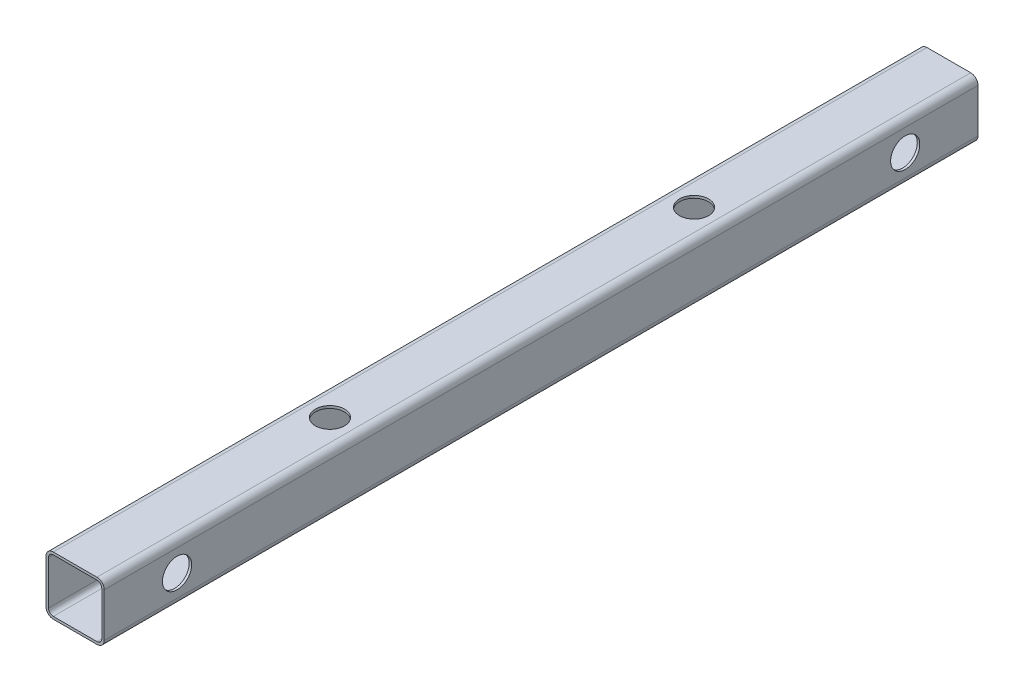
ISO-10303-21;
HEADER;
FILE_DESCRIPTION(('STEP AP214'),'2;1');
FILE_NAME('part.step','',(''),(''),'','','');
FILE_SCHEMA(('AUTOMOTIVE_DESIGN { 1 0 10303 214 1 1 1 1 }'));
ENDSEC;
DATA;
#1=APPLICATION_CONTEXT('core data for automotive mechanical design processes');
#2=APPLICATION_PROTOCOL_DEFINITION('international standard','automotive_design',2000,#1);
#3=PRODUCT_CONTEXT('',#1,'mechanical');
#4=PRODUCT('Part','Part','',(#3));
#5=PRODUCT_RELATED_PRODUCT_CATEGORY('part','',(#4));
#6=PRODUCT_DEFINITION_FORMATION('','',#4);
#7=PRODUCT_DEFINITION_CONTEXT('part definition',#1,'design');
#8=PRODUCT_DEFINITION('design','',#6,#7);
#9=PRODUCT_DEFINITION_SHAPE('','',#8);
#10=(LENGTH_UNIT() NAMED_UNIT(*) SI_UNIT(.MILLI.,.METRE.));
#11=(NAMED_UNIT(*) PLANE_ANGLE_UNIT() SI_UNIT($,.RADIAN.));
#12=(NAMED_UNIT(*) SI_UNIT($,.STERADIAN.) SOLID_ANGLE_UNIT());
#13=UNCERTAINTY_MEASURE_WITH_UNIT(LENGTH_MEASURE(1.E-05),#10,'distance_accuracy_value','');
#14=(GEOMETRIC_REPRESENTATION_CONTEXT(3) GLOBAL_UNCERTAINTY_ASSIGNED_CONTEXT((#13)) GLOBAL_UNIT_ASSIGNED_CONTEXT((#10,
#11,#12)) REPRESENTATION_CONTEXT('',''));
#15=CARTESIAN_POINT('',(0.,0.,0.));
#16=DIRECTION('',(0.,0.,1.));
#17=DIRECTION('',(1.,0.,0.));
#18=AXIS2_PLACEMENT_3D('',#15,#16,#17);
#19=CARTESIAN_POINT('',(-6.,-6.,-120.));
#20=DIRECTION('',(0.,0.,1.));
#21=DIRECTION('',(1.,0.,0.));
#22=AXIS2_PLACEMENT_3D('',#19,#20,#21);
#23=CYLINDRICAL_SURFACE('',#22,2.);
#24=DIRECTION('',(0.,0.,1.));
#25=VECTOR('',#24,1.);
#26=CARTESIAN_POINT('',(-5.99999999999999,-8.,-120.));
#27=LINE('',#26,#25);
#28=CARTESIAN_POINT('',(-5.99999999999999,-8.,-120.));
#29=VERTEX_POINT('',#28);
#30=CARTESIAN_POINT('',(-5.99999999999999,-8.,120.));
#31=VERTEX_POINT('',#30);
#32=EDGE_CURVE('E270',#29,#31,#27,.T.);
#33=ORIENTED_EDGE('',*,*,#32,.T.);
#34=CARTESIAN_POINT('',(-6.,-6.,120.));
#35=DIRECTION('',(0.,0.,1.));
#36=DIRECTION('',(-1.,0.,0.));
#37=AXIS2_PLACEMENT_3D('',#34,#35,#36);
#38=CIRCLE('',#37,2.);
#39=CARTESIAN_POINT('',(-8.,-5.99999999999999,120.));
#40=VERTEX_POINT('',#39);
#41=EDGE_CURVE('E194',#40,#31,#38,.T.);
#42=ORIENTED_EDGE('',*,*,#41,.F.);
#43=DIRECTION('',(0.,0.,1.));
#44=VECTOR('',#43,1.);
#45=CARTESIAN_POINT('',(-8.,-5.99999999999999,-120.));
#46=LINE('',#45,#44);
#47=CARTESIAN_POINT('',(-8.,-5.99999999999999,-120.));
#48=VERTEX_POINT('',#47);
#49=EDGE_CURVE('E11',#48,#40,#46,.T.);
#50=ORIENTED_EDGE('',*,*,#49,.F.);
#51=CARTESIAN_POINT('',(-6.,-6.,-120.));
#52=DIRECTION('',(0.,0.,1.));
#53=DIRECTION('',(-1.,0.,0.));
#54=AXIS2_PLACEMENT_3D('',#51,#52,#53);
#55=CIRCLE('',#54,2.);
#56=EDGE_CURVE('E237',#48,#29,#55,.T.);
#57=ORIENTED_EDGE('',*,*,#56,.T.);
#58=EDGE_LOOP('',(#33,#42,#50,#57));
#59=FACE_BOUND('',#58,.T.);
#60=ADVANCED_FACE('F36',(#59),#23,.T.);
#61=CARTESIAN_POINT('',(-8.,-5.99999999999999,-120.));
#62=DIRECTION('',(-1.,0.,0.));
#63=DIRECTION('',(0.,0.,1.));
#64=AXIS2_PLACEMENT_3D('',#61,#62,#63);
#65=PLANE('',#64);
#66=CARTESIAN_POINT('',(-8.,0.,100.));
#67=DIRECTION('',(1.,0.,0.));
#68=DIRECTION('',(0.,0.,-1.));
#69=AXIS2_PLACEMENT_3D('',#66,#67,#68);
#70=CIRCLE('',#69,3.99999999999999);
#71=CARTESIAN_POINT('',(-8.,0.,96.));
#72=VERTEX_POINT('',#71);
#73=EDGE_CURVE('E296',#72,#72,#70,.T.);
#74=ORIENTED_EDGE('',*,*,#73,.T.);
#75=EDGE_LOOP('',(#74));
#76=FACE_BOUND('',#75,.T.);
#77=CARTESIAN_POINT('',(-8.,0.,-100.));
#78=DIRECTION('',(1.,0.,0.));
#79=DIRECTION('',(0.,0.,1.));
#80=AXIS2_PLACEMENT_3D('',#77,#78,#79);
#81=CIRCLE('',#80,3.99999999999999);
#82=CARTESIAN_POINT('',(-8.,0.,-96.));
#83=VERTEX_POINT('',#82);
#84=EDGE_CURVE('E307',#83,#83,#81,.T.);
#85=ORIENTED_EDGE('',*,*,#84,.T.);
#86=EDGE_LOOP('',(#85));
#87=FACE_BOUND('',#86,.T.);
#88=ORIENTED_EDGE('',*,*,#49,.T.);
#89=DIRECTION('',(0.,-1.,0.));
#90=VECTOR('',#89,1.);
#91=CARTESIAN_POINT('',(-8.,-5.99999999999999,120.));
#92=LINE('',#91,#90);
#93=CARTESIAN_POINT('',(-8.,5.99999999999999,120.));
#94=VERTEX_POINT('',#93);
#95=EDGE_CURVE('E215',#94,#40,#92,.T.);
#96=ORIENTED_EDGE('',*,*,#95,.F.);
#97=DIRECTION('',(0.,0.,1.));
#98=VECTOR('',#97,1.);
#99=CARTESIAN_POINT('',(-8.,5.99999999999999,-120.));
#100=LINE('',#99,#98);
#101=CARTESIAN_POINT('',(-8.,5.99999999999999,-120.));
#102=VERTEX_POINT('',#101);
#103=EDGE_CURVE('E44',#102,#94,#100,.T.);
#104=ORIENTED_EDGE('',*,*,#103,.F.);
#105=DIRECTION('',(0.,-1.,0.));
#106=VECTOR('',#105,1.);
#107=CARTESIAN_POINT('',(-8.,-5.99999999999999,-120.));
#108=LINE('',#107,#106);
#109=EDGE_CURVE('E268',#102,#48,#108,.T.);
#110=ORIENTED_EDGE('',*,*,#109,.T.);
#111=EDGE_LOOP('',(#88,#96,#104,#110));
#112=FACE_BOUND('',#111,.T.);
#113=ADVANCED_FACE('F351',(#76,#87,#112),#65,.T.);
#114=CARTESIAN_POINT('',(-6.,6.,-120.));
#115=DIRECTION('',(0.,0.,1.));
#116=DIRECTION('',(1.,0.,0.));
#117=AXIS2_PLACEMENT_3D('',#114,#115,#116);
#118=CYLINDRICAL_SURFACE('',#117,2.);
#119=ORIENTED_EDGE('',*,*,#103,.T.);
#120=CARTESIAN_POINT('',(-6.,6.,120.));
#121=DIRECTION('',(0.,0.,1.));
#122=DIRECTION('',(-1.,0.,0.));
#123=AXIS2_PLACEMENT_3D('',#120,#121,#122);
#124=CIRCLE('',#123,2.);
#125=CARTESIAN_POINT('',(-5.99999999999999,8.,120.));
#126=VERTEX_POINT('',#125);
#127=EDGE_CURVE('E212',#126,#94,#124,.T.);
#128=ORIENTED_EDGE('',*,*,#127,.F.);
#129=DIRECTION('',(0.,0.,1.));
#130=VECTOR('',#129,1.);
#131=CARTESIAN_POINT('',(-5.99999999999999,8.,-120.));
#132=LINE('',#131,#130);
#133=CARTESIAN_POINT('',(-5.99999999999999,8.,-120.));
#134=VERTEX_POINT('',#133);
#135=EDGE_CURVE('E273',#134,#126,#132,.T.);
#136=ORIENTED_EDGE('',*,*,#135,.F.);
#137=CARTESIAN_POINT('',(-6.,6.,-120.));
#138=DIRECTION('',(0.,0.,1.));
#139=DIRECTION('',(-1.,0.,0.));
#140=AXIS2_PLACEMENT_3D('',#137,#138,#139);
#141=CIRCLE('',#140,2.);
#142=EDGE_CURVE('E265',#134,#102,#141,.T.);
#143=ORIENTED_EDGE('',*,*,#142,.T.);
#144=EDGE_LOOP('',(#119,#128,#136,#143));
#145=FACE_BOUND('',#144,.T.);
#146=ADVANCED_FACE('F338',(#145),#118,.T.);
#147=CARTESIAN_POINT('',(-5.99999999999999,8.,-120.));
#148=DIRECTION('',(0.,1.,0.));
#149=DIRECTION('',(0.,0.,1.));
#150=AXIS2_PLACEMENT_3D('',#147,#148,#149);
#151=PLANE('',#150);
#152=CARTESIAN_POINT('',(0.,8.,-50.));
#153=DIRECTION('',(0.,1.,0.));
#154=DIRECTION('',(0.,0.,1.));
#155=AXIS2_PLACEMENT_3D('',#152,#153,#154);
#156=CIRCLE('',#155,4.);
#157=CARTESIAN_POINT('',(0.,8.,-46.));
#158=VERTEX_POINT('',#157);
#159=EDGE_CURVE('E322',#158,#158,#156,.F.);
#160=ORIENTED_EDGE('',*,*,#159,.T.);
#161=EDGE_LOOP('',(#160));
#162=FACE_BOUND('',#161,.T.);
#163=CARTESIAN_POINT('',(0.,8.,50.));
#164=DIRECTION('',(0.,1.,0.));
#165=DIRECTION('',(0.,0.,1.));
#166=AXIS2_PLACEMENT_3D('',#163,#164,#165);
#167=CIRCLE('',#166,4.);
#168=CARTESIAN_POINT('',(0.,8.,54.));
#169=VERTEX_POINT('',#168);
#170=EDGE_CURVE('E170',#169,#169,#167,.T.);
#171=ORIENTED_EDGE('',*,*,#170,.F.);
#172=EDGE_LOOP('',(#171));
#173=FACE_BOUND('',#172,.T.);
#174=ORIENTED_EDGE('',*,*,#135,.T.);
#175=DIRECTION('',(-1.,0.,0.));
#176=VECTOR('',#175,1.);
#177=CARTESIAN_POINT('',(-5.99999999999999,8.,120.));
#178=LINE('',#177,#176);
#179=CARTESIAN_POINT('',(5.99999999999999,8.,120.));
#180=VERTEX_POINT('',#179);
#181=EDGE_CURVE('E209',#180,#126,#178,.T.);
#182=ORIENTED_EDGE('',*,*,#181,.F.);
#183=DIRECTION('',(0.,0.,1.));
#184=VECTOR('',#183,1.);
#185=CARTESIAN_POINT('',(5.99999999999999,8.,-120.));
#186=LINE('',#185,#184);
#187=CARTESIAN_POINT('',(5.99999999999999,8.,-120.));
#188=VERTEX_POINT('',#187);
#189=EDGE_CURVE('E275',#188,#180,#186,.T.);
#190=ORIENTED_EDGE('',*,*,#189,.F.);
#191=DIRECTION('',(-1.,0.,0.));
#192=VECTOR('',#191,1.);
#193=CARTESIAN_POINT('',(-5.99999999999999,8.,-120.));
#194=LINE('',#193,#192);
#195=EDGE_CURVE('E262',#188,#134,#194,.T.);
#196=ORIENTED_EDGE('',*,*,#195,.T.);
#197=EDGE_LOOP('',(#174,#182,#190,#196));
#198=FACE_BOUND('',#197,.T.);
#199=ADVANCED_FACE('F334',(#162,#173,#198),#151,.T.);
#200=CARTESIAN_POINT('',(6.,6.,-120.));
#201=DIRECTION('',(0.,0.,1.));
#202=DIRECTION('',(1.,0.,0.));
#203=AXIS2_PLACEMENT_3D('',#200,#201,#202);
#204=CYLINDRICAL_SURFACE('',#203,2.);
#205=ORIENTED_EDGE('',*,*,#189,.T.);
#206=CARTESIAN_POINT('',(6.,6.,120.));
#207=DIRECTION('',(0.,0.,1.));
#208=DIRECTION('',(-1.,0.,0.));
#209=AXIS2_PLACEMENT_3D('',#206,#207,#208);
#210=CIRCLE('',#209,2.);
#211=CARTESIAN_POINT('',(8.,5.99999999999999,120.));
#212=VERTEX_POINT('',#211);
#213=EDGE_CURVE('E206',#212,#180,#210,.T.);
#214=ORIENTED_EDGE('',*,*,#213,.F.);
#215=DIRECTION('',(0.,0.,1.));
#216=VECTOR('',#215,1.);
#217=CARTESIAN_POINT('',(8.,5.99999999999999,-120.));
#218=LINE('',#217,#216);
#219=CARTESIAN_POINT('',(8.,5.99999999999999,-120.));
#220=VERTEX_POINT('',#219);
#221=EDGE_CURVE('E277',#220,#212,#218,.T.);
#222=ORIENTED_EDGE('',*,*,#221,.F.);
#223=CARTESIAN_POINT('',(6.,6.,-120.));
#224=DIRECTION('',(0.,0.,1.));
#225=DIRECTION('',(-1.,0.,0.));
#226=AXIS2_PLACEMENT_3D('',#223,#224,#225);
#227=CIRCLE('',#226,2.);
#228=EDGE_CURVE('E259',#220,#188,#227,.T.);
#229=ORIENTED_EDGE('',*,*,#228,.T.);
#230=EDGE_LOOP('',(#205,#214,#222,#229));
#231=FACE_BOUND('',#230,.T.);
#232=ADVANCED_FACE('F337',(#231),#204,.T.);
#233=CARTESIAN_POINT('',(8.,-5.99999999999999,-120.));
#234=DIRECTION('',(1.,0.,0.));
#235=DIRECTION('',(0.,0.,-1.));
#236=AXIS2_PLACEMENT_3D('',#233,#234,#235);
#237=PLANE('',#236);
#238=CARTESIAN_POINT('',(8.,0.,100.));
#239=DIRECTION('',(1.,0.,0.));
#240=DIRECTION('',(0.,0.,-1.));
#241=AXIS2_PLACEMENT_3D('',#238,#239,#240);
#242=CIRCLE('',#241,3.99999999999999);
#243=CARTESIAN_POINT('',(8.,0.,96.));
#244=VERTEX_POINT('',#243);
#245=EDGE_CURVE('E302',#244,#244,#242,.T.);
#246=ORIENTED_EDGE('',*,*,#245,.F.);
#247=EDGE_LOOP('',(#246));
#248=FACE_BOUND('',#247,.T.);
#249=CARTESIAN_POINT('',(8.,0.,-100.));
#250=DIRECTION('',(1.,0.,0.));
#251=DIRECTION('',(0.,0.,1.));
#252=AXIS2_PLACEMENT_3D('',#249,#250,#251);
#253=CIRCLE('',#252,3.99999999999999);
#254=CARTESIAN_POINT('',(8.,0.,-96.));
#255=VERTEX_POINT('',#254);
#256=EDGE_CURVE('E312',#255,#255,#253,.T.);
#257=ORIENTED_EDGE('',*,*,#256,.F.);
#258=EDGE_LOOP('',(#257));
#259=FACE_BOUND('',#258,.T.);
#260=ORIENTED_EDGE('',*,*,#221,.T.);
#261=DIRECTION('',(0.,1.,0.));
#262=VECTOR('',#261,1.);
#263=CARTESIAN_POINT('',(8.,-5.99999999999999,120.));
#264=LINE('',#263,#262);
#265=CARTESIAN_POINT('',(8.,-6.,120.));
#266=VERTEX_POINT('',#265);
#267=EDGE_CURVE('E203',#266,#212,#264,.T.);
#268=ORIENTED_EDGE('',*,*,#267,.F.);
#269=DIRECTION('',(0.,0.,1.));
#270=VECTOR('',#269,1.);
#271=CARTESIAN_POINT('',(8.,-6.,-120.));
#272=LINE('',#271,#270);
#273=CARTESIAN_POINT('',(8.,-6.,-120.));
#274=VERTEX_POINT('',#273);
#275=EDGE_CURVE('E279',#274,#266,#272,.T.);
#276=ORIENTED_EDGE('',*,*,#275,.F.);
#277=DIRECTION('',(0.,1.,0.));
#278=VECTOR('',#277,1.);
#279=CARTESIAN_POINT('',(8.,-5.99999999999999,-120.));
#280=LINE('',#279,#278);
#281=EDGE_CURVE('E256',#274,#220,#280,.T.);
#282=ORIENTED_EDGE('',*,*,#281,.T.);
#283=EDGE_LOOP('',(#260,#268,#276,#282));
#284=FACE_BOUND('',#283,.T.);
#285=ADVANCED_FACE('F363',(#248,#259,#284),#237,.T.);
#286=CARTESIAN_POINT('',(6.,-6.,-120.));
#287=DIRECTION('',(0.,0.,1.));
#288=DIRECTION('',(1.,0.,0.));
#289=AXIS2_PLACEMENT_3D('',#286,#287,#288);
#290=CYLINDRICAL_SURFACE('',#289,2.);
#291=ORIENTED_EDGE('',*,*,#275,.T.);
#292=CARTESIAN_POINT('',(6.,-6.,120.));
#293=DIRECTION('',(0.,0.,1.));
#294=DIRECTION('',(1.,0.,0.));
#295=AXIS2_PLACEMENT_3D('',#292,#293,#294);
#296=CIRCLE('',#295,2.);
#297=CARTESIAN_POINT('',(5.99999999999999,-8.,120.));
#298=VERTEX_POINT('',#297);
#299=EDGE_CURVE('E200',#298,#266,#296,.T.);
#300=ORIENTED_EDGE('',*,*,#299,.F.);
#301=DIRECTION('',(0.,0.,1.));
#302=VECTOR('',#301,1.);
#303=CARTESIAN_POINT('',(5.99999999999999,-8.,-120.));
#304=LINE('',#303,#302);
#305=CARTESIAN_POINT('',(5.99999999999999,-8.,-120.));
#306=VERTEX_POINT('',#305);
#307=EDGE_CURVE('E281',#306,#298,#304,.T.);
#308=ORIENTED_EDGE('',*,*,#307,.F.);
#309=CARTESIAN_POINT('',(6.,-6.,-120.));
#310=DIRECTION('',(0.,0.,1.));
#311=DIRECTION('',(1.,0.,0.));
#312=AXIS2_PLACEMENT_3D('',#309,#310,#311);
#313=CIRCLE('',#312,2.);
#314=EDGE_CURVE('E253',#306,#274,#313,.T.);
#315=ORIENTED_EDGE('',*,*,#314,.T.);
#316=EDGE_LOOP('',(#291,#300,#308,#315));
#317=FACE_BOUND('',#316,.T.);
#318=ADVANCED_FACE('F359',(#317),#290,.T.);
#319=CARTESIAN_POINT('',(-5.99999999999999,-8.,-120.));
#320=DIRECTION('',(0.,-1.,0.));
#321=DIRECTION('',(0.,0.,-1.));
#322=AXIS2_PLACEMENT_3D('',#319,#320,#321);
#323=PLANE('',#322);
#324=CARTESIAN_POINT('',(0.,-8.,-50.));
#325=DIRECTION('',(0.,-1.,0.));
#326=DIRECTION('',(0.,0.,-1.));
#327=AXIS2_PLACEMENT_3D('',#324,#325,#326);
#328=CIRCLE('',#327,4.);
#329=CARTESIAN_POINT('',(0.,-8.,-54.));
#330=VERTEX_POINT('',#329);
#331=EDGE_CURVE('E292',#330,#330,#328,.T.);
#332=ORIENTED_EDGE('',*,*,#331,.F.);
#333=EDGE_LOOP('',(#332));
#334=FACE_BOUND('',#333,.T.);
#335=CARTESIAN_POINT('',(0.,-8.,50.));
#336=DIRECTION('',(0.,1.,0.));
#337=DIRECTION('',(0.,0.,1.));
#338=AXIS2_PLACEMENT_3D('',#335,#336,#337);
#339=CIRCLE('',#338,4.);
#340=CARTESIAN_POINT('',(0.,-8.,54.));
#341=VERTEX_POINT('',#340);
#342=EDGE_CURVE('E288',#341,#341,#339,.T.);
#343=ORIENTED_EDGE('',*,*,#342,.T.);
#344=EDGE_LOOP('',(#343));
#345=FACE_BOUND('',#344,.T.);
#346=ORIENTED_EDGE('',*,*,#307,.T.);
#347=DIRECTION('',(1.,0.,0.));
#348=VECTOR('',#347,1.);
#349=CARTESIAN_POINT('',(-5.99999999999999,-8.,120.));
#350=LINE('',#349,#348);
#351=EDGE_CURVE('E197',#31,#298,#350,.T.);
#352=ORIENTED_EDGE('',*,*,#351,.F.);
#353=ORIENTED_EDGE('',*,*,#32,.F.);
#354=DIRECTION('',(1.,0.,0.));
#355=VECTOR('',#354,1.);
#356=CARTESIAN_POINT('',(-5.99999999999999,-8.,-120.));
#357=LINE('',#356,#355);
#358=EDGE_CURVE('E250',#29,#306,#357,.T.);
#359=ORIENTED_EDGE('',*,*,#358,.T.);
#360=EDGE_LOOP('',(#346,#352,#353,#359));
#361=FACE_BOUND('',#360,.T.);
#362=ADVANCED_FACE('F355',(#334,#345,#361),#323,.T.);
#363=CARTESIAN_POINT('',(-6.,-6.,-120.));
#364=DIRECTION('',(0.,0.,-1.));
#365=DIRECTION('',(-1.,0.,0.));
#366=AXIS2_PLACEMENT_3D('',#363,#364,#365);
#367=PLANE('',#366);
#368=CARTESIAN_POINT('',(-6.,6.,-120.));
#369=DIRECTION('',(0.,0.,1.));
#370=DIRECTION('',(-1.,0.,0.));
#371=AXIS2_PLACEMENT_3D('',#368,#369,#370);
#372=CIRCLE('',#371,1.32);
#373=CARTESIAN_POINT('',(-5.99999999999999,7.32,-120.));
#374=VERTEX_POINT('',#373);
#375=CARTESIAN_POINT('',(-7.32,5.99999999999999,-120.));
#376=VERTEX_POINT('',#375);
#377=EDGE_CURVE('E218',#374,#376,#372,.T.);
#378=ORIENTED_EDGE('',*,*,#377,.T.);
#379=DIRECTION('',(0.,-1.,0.));
#380=VECTOR('',#379,1.);
#381=CARTESIAN_POINT('',(-7.32,-5.99999999999999,-120.));
#382=LINE('',#381,#380);
#383=CARTESIAN_POINT('',(-7.32,-6.,-120.));
#384=VERTEX_POINT('',#383);
#385=EDGE_CURVE('E156',#376,#384,#382,.T.);
#386=ORIENTED_EDGE('',*,*,#385,.T.);
#387=CARTESIAN_POINT('',(-6.,-6.,-120.));
#388=DIRECTION('',(0.,0.,1.));
#389=DIRECTION('',(-1.,0.,0.));
#390=AXIS2_PLACEMENT_3D('',#387,#388,#389);
#391=CIRCLE('',#390,1.32);
#392=CARTESIAN_POINT('',(-5.99999999999999,-7.32,-120.));
#393=VERTEX_POINT('',#392);
#394=EDGE_CURVE('E52',#384,#393,#391,.T.);
#395=ORIENTED_EDGE('',*,*,#394,.T.);
#396=DIRECTION('',(1.,0.,0.));
#397=VECTOR('',#396,1.);
#398=CARTESIAN_POINT('',(-5.99999999999999,-7.32,-120.));
#399=LINE('',#398,#397);
#400=CARTESIAN_POINT('',(5.99999999999999,-7.32,-120.));
#401=VERTEX_POINT('',#400);
#402=EDGE_CURVE('E222',#393,#401,#399,.T.);
#403=ORIENTED_EDGE('',*,*,#402,.T.);
#404=CARTESIAN_POINT('',(6.,-6.,-120.));
#405=DIRECTION('',(0.,0.,1.));
#406=DIRECTION('',(1.,0.,0.));
#407=AXIS2_PLACEMENT_3D('',#404,#405,#406);
#408=CIRCLE('',#407,1.32);
#409=CARTESIAN_POINT('',(7.32,-5.99999999999999,-120.));
#410=VERTEX_POINT('',#409);
#411=EDGE_CURVE('E225',#401,#410,#408,.T.);
#412=ORIENTED_EDGE('',*,*,#411,.T.);
#413=DIRECTION('',(0.,1.,0.));
#414=VECTOR('',#413,1.);
#415=CARTESIAN_POINT('',(7.32,-5.99999999999999,-120.));
#416=LINE('',#415,#414);
#417=CARTESIAN_POINT('',(7.32,5.99999999999999,-120.));
#418=VERTEX_POINT('',#417);
#419=EDGE_CURVE('E228',#410,#418,#416,.T.);
#420=ORIENTED_EDGE('',*,*,#419,.T.);
#421=CARTESIAN_POINT('',(6.,6.,-120.));
#422=DIRECTION('',(0.,0.,1.));
#423=DIRECTION('',(-1.,0.,0.));
#424=AXIS2_PLACEMENT_3D('',#421,#422,#423);
#425=CIRCLE('',#424,1.32);
#426=CARTESIAN_POINT('',(5.99999999999999,7.32,-120.));
#427=VERTEX_POINT('',#426);
#428=EDGE_CURVE('E231',#418,#427,#425,.T.);
#429=ORIENTED_EDGE('',*,*,#428,.T.);
#430=DIRECTION('',(-1.,0.,0.));
#431=VECTOR('',#430,1.);
#432=CARTESIAN_POINT('',(-5.99999999999999,7.32,-120.));
#433=LINE('',#432,#431);
#434=EDGE_CURVE('E161',#427,#374,#433,.T.);
#435=ORIENTED_EDGE('',*,*,#434,.T.);
#436=EDGE_LOOP('',(#378,#386,#395,#403,#412,#420,#429,#435));
#437=FACE_BOUND('',#436,.T.);
#438=ORIENTED_EDGE('',*,*,#56,.F.);
#439=ORIENTED_EDGE('',*,*,#109,.F.);
#440=ORIENTED_EDGE('',*,*,#142,.F.);
#441=ORIENTED_EDGE('',*,*,#195,.F.);
#442=ORIENTED_EDGE('',*,*,#228,.F.);
#443=ORIENTED_EDGE('',*,*,#281,.F.);
#444=ORIENTED_EDGE('',*,*,#314,.F.);
#445=ORIENTED_EDGE('',*,*,#358,.F.);
#446=EDGE_LOOP('',(#438,#439,#440,#441,#442,#443,#444,#445));
#447=FACE_BOUND('',#446,.T.);
#448=ADVANCED_FACE('F366',(#437,#447),#367,.T.);
#449=CARTESIAN_POINT('',(-6.,6.,-120.));
#450=DIRECTION('',(0.,0.,1.));
#451=DIRECTION('',(1.,0.,0.));
#452=AXIS2_PLACEMENT_3D('',#449,#450,#451);
#453=CYLINDRICAL_SURFACE('',#452,1.32);
#454=DIRECTION('',(0.,0.,1.));
#455=VECTOR('',#454,1.);
#456=CARTESIAN_POINT('',(-5.99999999999999,7.32,-120.));
#457=LINE('',#456,#455);
#458=CARTESIAN_POINT('',(-5.99999999999999,7.32,120.));
#459=VERTEX_POINT('',#458);
#460=EDGE_CURVE('E166',#374,#459,#457,.T.);
#461=ORIENTED_EDGE('',*,*,#460,.T.);
#462=CARTESIAN_POINT('',(-6.,6.,120.));
#463=DIRECTION('',(0.,0.,1.));
#464=DIRECTION('',(-1.,0.,0.));
#465=AXIS2_PLACEMENT_3D('',#462,#463,#464);
#466=CIRCLE('',#465,1.32);
#467=CARTESIAN_POINT('',(-7.32,5.99999999999999,120.));
#468=VERTEX_POINT('',#467);
#469=EDGE_CURVE('E164',#459,#468,#466,.T.);
#470=ORIENTED_EDGE('',*,*,#469,.T.);
#471=DIRECTION('',(0.,0.,1.));
#472=VECTOR('',#471,1.);
#473=CARTESIAN_POINT('',(-7.32,5.99999999999999,-120.));
#474=LINE('',#473,#472);
#475=EDGE_CURVE('E149',#376,#468,#474,.T.);
#476=ORIENTED_EDGE('',*,*,#475,.F.);
#477=ORIENTED_EDGE('',*,*,#377,.F.);
#478=EDGE_LOOP('',(#461,#470,#476,#477));
#479=FACE_BOUND('',#478,.T.);
#480=ADVANCED_FACE('F165',(#479),#453,.F.);
#481=CARTESIAN_POINT('',(-5.99999999999999,7.32,-120.));
#482=DIRECTION('',(0.,1.,0.));
#483=DIRECTION('',(0.,0.,1.));
#484=AXIS2_PLACEMENT_3D('',#481,#482,#483);
#485=PLANE('',#484);
#486=CARTESIAN_POINT('',(0.,7.32,-50.));
#487=DIRECTION('',(0.,1.,0.));
#488=DIRECTION('',(0.,0.,1.));
#489=AXIS2_PLACEMENT_3D('',#486,#487,#488);
#490=CIRCLE('',#489,4.);
#491=CARTESIAN_POINT('',(0.,7.32,-46.));
#492=VERTEX_POINT('',#491);
#493=EDGE_CURVE('E291',#492,#492,#490,.F.);
#494=ORIENTED_EDGE('',*,*,#493,.F.);
#495=EDGE_LOOP('',(#494));
#496=FACE_BOUND('',#495,.T.);
#497=CARTESIAN_POINT('',(0.,7.32,50.));
#498=DIRECTION('',(0.,1.,0.));
#499=DIRECTION('',(0.,0.,1.));
#500=AXIS2_PLACEMENT_3D('',#497,#498,#499);
#501=CIRCLE('',#500,4.);
#502=CARTESIAN_POINT('',(0.,7.32,54.));
#503=VERTEX_POINT('',#502);
#504=EDGE_CURVE('E287',#503,#503,#501,.T.);
#505=ORIENTED_EDGE('',*,*,#504,.T.);
#506=EDGE_LOOP('',(#505));
#507=FACE_BOUND('',#506,.T.);
#508=DIRECTION('',(0.,0.,1.));
#509=VECTOR('',#508,1.);
#510=CARTESIAN_POINT('',(5.99999999999999,7.32,-120.));
#511=LINE('',#510,#509);
#512=CARTESIAN_POINT('',(5.99999999999999,7.32,120.));
#513=VERTEX_POINT('',#512);
#514=EDGE_CURVE('E238',#427,#513,#511,.T.);
#515=ORIENTED_EDGE('',*,*,#514,.T.);
#516=DIRECTION('',(-1.,0.,0.));
#517=VECTOR('',#516,1.);
#518=CARTESIAN_POINT('',(-5.99999999999999,7.32,120.));
#519=LINE('',#518,#517);
#520=EDGE_CURVE('E192',#513,#459,#519,.T.);
#521=ORIENTED_EDGE('',*,*,#520,.T.);
#522=ORIENTED_EDGE('',*,*,#460,.F.);
#523=ORIENTED_EDGE('',*,*,#434,.F.);
#524=EDGE_LOOP('',(#515,#521,#522,#523));
#525=FACE_BOUND('',#524,.T.);
#526=ADVANCED_FACE('F391',(#496,#507,#525),#485,.F.);
#527=CARTESIAN_POINT('',(6.,6.,-120.));
#528=DIRECTION('',(0.,0.,1.));
#529=DIRECTION('',(1.,0.,0.));
#530=AXIS2_PLACEMENT_3D('',#527,#528,#529);
#531=CYLINDRICAL_SURFACE('',#530,1.32);
#532=DIRECTION('',(0.,0.,1.));
#533=VECTOR('',#532,1.);
#534=CARTESIAN_POINT('',(7.32,5.99999999999999,-120.));
#535=LINE('',#534,#533);
#536=CARTESIAN_POINT('',(7.32,5.99999999999999,120.));
#537=VERTEX_POINT('',#536);
#538=EDGE_CURVE('E240',#418,#537,#535,.T.);
#539=ORIENTED_EDGE('',*,*,#538,.T.);
#540=CARTESIAN_POINT('',(6.,6.,120.));
#541=DIRECTION('',(0.,0.,1.));
#542=DIRECTION('',(-1.,0.,0.));
#543=AXIS2_PLACEMENT_3D('',#540,#541,#542);
#544=CIRCLE('',#543,1.32);
#545=EDGE_CURVE('E189',#537,#513,#544,.T.);
#546=ORIENTED_EDGE('',*,*,#545,.T.);
#547=ORIENTED_EDGE('',*,*,#514,.F.);
#548=ORIENTED_EDGE('',*,*,#428,.F.);
#549=EDGE_LOOP('',(#539,#546,#547,#548));
#550=FACE_BOUND('',#549,.T.);
#551=ADVANCED_FACE('F409',(#550),#531,.F.);
#552=CARTESIAN_POINT('',(7.32,-5.99999999999999,-120.));
#553=DIRECTION('',(1.,0.,0.));
#554=DIRECTION('',(0.,0.,-1.));
#555=AXIS2_PLACEMENT_3D('',#552,#553,#554);
#556=PLANE('',#555);
#557=CARTESIAN_POINT('',(7.32,0.,100.));
#558=DIRECTION('',(1.,0.,0.));
#559=DIRECTION('',(0.,0.,-1.));
#560=AXIS2_PLACEMENT_3D('',#557,#558,#559);
#561=CIRCLE('',#560,3.99999999999999);
#562=CARTESIAN_POINT('',(7.32,0.,96.));
#563=VERTEX_POINT('',#562);
#564=EDGE_CURVE('E315',#563,#563,#561,.T.);
#565=ORIENTED_EDGE('',*,*,#564,.T.);
#566=EDGE_LOOP('',(#565));
#567=FACE_BOUND('',#566,.T.);
#568=CARTESIAN_POINT('',(7.32,0.,-100.));
#569=DIRECTION('',(1.,0.,0.));
#570=DIRECTION('',(0.,0.,-1.));
#571=AXIS2_PLACEMENT_3D('',#568,#569,#570);
#572=CIRCLE('',#571,3.99999999999999);
#573=CARTESIAN_POINT('',(7.32,0.,-104.));
#574=VERTEX_POINT('',#573);
#575=EDGE_CURVE('E295',#574,#574,#572,.T.);
#576=ORIENTED_EDGE('',*,*,#575,.T.);
#577=EDGE_LOOP('',(#576));
#578=FACE_BOUND('',#577,.T.);
#579=DIRECTION('',(0.,0.,1.));
#580=VECTOR('',#579,1.);
#581=CARTESIAN_POINT('',(7.32,-5.99999999999999,-120.));
#582=LINE('',#581,#580);
#583=CARTESIAN_POINT('',(7.32,-5.99999999999999,120.));
#584=VERTEX_POINT('',#583);
#585=EDGE_CURVE('E242',#410,#584,#582,.T.);
#586=ORIENTED_EDGE('',*,*,#585,.T.);
#587=DIRECTION('',(0.,1.,0.));
#588=VECTOR('',#587,1.);
#589=CARTESIAN_POINT('',(7.32,-5.99999999999999,120.));
#590=LINE('',#589,#588);
#591=EDGE_CURVE('E186',#584,#537,#590,.T.);
#592=ORIENTED_EDGE('',*,*,#591,.T.);
#593=ORIENTED_EDGE('',*,*,#538,.F.);
#594=ORIENTED_EDGE('',*,*,#419,.F.);
#595=EDGE_LOOP('',(#586,#592,#593,#594));
#596=FACE_BOUND('',#595,.T.);
#597=ADVANCED_FACE('F405',(#567,#578,#596),#556,.F.);
#598=CARTESIAN_POINT('',(6.,-6.,-120.));
#599=DIRECTION('',(0.,0.,1.));
#600=DIRECTION('',(1.,0.,0.));
#601=AXIS2_PLACEMENT_3D('',#598,#599,#600);
#602=CYLINDRICAL_SURFACE('',#601,1.32);
#603=DIRECTION('',(0.,0.,1.));
#604=VECTOR('',#603,1.);
#605=CARTESIAN_POINT('',(5.99999999999999,-7.32,-120.));
#606=LINE('',#605,#604);
#607=CARTESIAN_POINT('',(5.99999999999999,-7.32,120.));
#608=VERTEX_POINT('',#607);
#609=EDGE_CURVE('E244',#401,#608,#606,.T.);
#610=ORIENTED_EDGE('',*,*,#609,.T.);
#611=CARTESIAN_POINT('',(6.,-6.,120.));
#612=DIRECTION('',(0.,0.,1.));
#613=DIRECTION('',(1.,0.,0.));
#614=AXIS2_PLACEMENT_3D('',#611,#612,#613);
#615=CIRCLE('',#614,1.32);
#616=EDGE_CURVE('E183',#608,#584,#615,.T.);
#617=ORIENTED_EDGE('',*,*,#616,.T.);
#618=ORIENTED_EDGE('',*,*,#585,.F.);
#619=ORIENTED_EDGE('',*,*,#411,.F.);
#620=EDGE_LOOP('',(#610,#617,#618,#619));
#621=FACE_BOUND('',#620,.T.);
#622=ADVANCED_FACE('F401',(#621),#602,.F.);
#623=CARTESIAN_POINT('',(-5.99999999999999,-7.32,-120.));
#624=DIRECTION('',(0.,-1.,0.));
#625=DIRECTION('',(0.,0.,-1.));
#626=AXIS2_PLACEMENT_3D('',#623,#624,#625);
#627=PLANE('',#626);
#628=CARTESIAN_POINT('',(0.,-7.32,-50.));
#629=DIRECTION('',(0.,-1.,0.));
#630=DIRECTION('',(0.,0.,-1.));
#631=AXIS2_PLACEMENT_3D('',#628,#629,#630);
#632=CIRCLE('',#631,4.);
#633=CARTESIAN_POINT('',(0.,-7.32,-54.));
#634=VERTEX_POINT('',#633);
#635=EDGE_CURVE('E289',#634,#634,#632,.F.);
#636=ORIENTED_EDGE('',*,*,#635,.F.);
#637=EDGE_LOOP('',(#636));
#638=FACE_BOUND('',#637,.T.);
#639=CARTESIAN_POINT('',(0.,-7.32,50.));
#640=DIRECTION('',(0.,-1.,0.));
#641=DIRECTION('',(0.,0.,-1.));
#642=AXIS2_PLACEMENT_3D('',#639,#640,#641);
#643=CIRCLE('',#642,4.);
#644=CARTESIAN_POINT('',(0.,-7.32,46.));
#645=VERTEX_POINT('',#644);
#646=EDGE_CURVE('E284',#645,#645,#643,.T.);
#647=ORIENTED_EDGE('',*,*,#646,.T.);
#648=EDGE_LOOP('',(#647));
#649=FACE_BOUND('',#648,.T.);
#650=DIRECTION('',(0.,0.,1.));
#651=VECTOR('',#650,1.);
#652=CARTESIAN_POINT('',(-5.99999999999999,-7.32,-120.));
#653=LINE('',#652,#651);
#654=CARTESIAN_POINT('',(-5.99999999999999,-7.32,120.));
#655=VERTEX_POINT('',#654);
#656=EDGE_CURVE('E246',#393,#655,#653,.T.);
#657=ORIENTED_EDGE('',*,*,#656,.T.);
#658=DIRECTION('',(1.,0.,0.));
#659=VECTOR('',#658,1.);
#660=CARTESIAN_POINT('',(-5.99999999999999,-7.32,120.));
#661=LINE('',#660,#659);
#662=EDGE_CURVE('E177',#655,#608,#661,.T.);
#663=ORIENTED_EDGE('',*,*,#662,.T.);
#664=ORIENTED_EDGE('',*,*,#609,.F.);
#665=ORIENTED_EDGE('',*,*,#402,.F.);
#666=EDGE_LOOP('',(#657,#663,#664,#665));
#667=FACE_BOUND('',#666,.T.);
#668=ADVANCED_FACE('F398',(#638,#649,#667),#627,.F.);
#669=CARTESIAN_POINT('',(-6.,-6.,-120.));
#670=DIRECTION('',(0.,0.,1.));
#671=DIRECTION('',(1.,0.,0.));
#672=AXIS2_PLACEMENT_3D('',#669,#670,#671);
#673=CYLINDRICAL_SURFACE('',#672,1.32);
#674=DIRECTION('',(0.,0.,1.));
#675=VECTOR('',#674,1.);
#676=CARTESIAN_POINT('',(-7.32,-6.,-120.));
#677=LINE('',#676,#675);
#678=CARTESIAN_POINT('',(-7.32,-6.,120.));
#679=VERTEX_POINT('',#678);
#680=EDGE_CURVE('E160',#384,#679,#677,.T.);
#681=ORIENTED_EDGE('',*,*,#680,.T.);
#682=CARTESIAN_POINT('',(-6.,-6.,120.));
#683=DIRECTION('',(0.,0.,1.));
#684=DIRECTION('',(-1.,0.,0.));
#685=AXIS2_PLACEMENT_3D('',#682,#683,#684);
#686=CIRCLE('',#685,1.32);
#687=EDGE_CURVE('E175',#679,#655,#686,.T.);
#688=ORIENTED_EDGE('',*,*,#687,.T.);
#689=ORIENTED_EDGE('',*,*,#656,.F.);
#690=ORIENTED_EDGE('',*,*,#394,.F.);
#691=EDGE_LOOP('',(#681,#688,#689,#690));
#692=FACE_BOUND('',#691,.T.);
#693=ADVANCED_FACE('F394',(#692),#673,.F.);
#694=CARTESIAN_POINT('',(-7.32,-5.99999999999999,-120.));
#695=DIRECTION('',(-1.,0.,0.));
#696=DIRECTION('',(0.,0.,1.));
#697=AXIS2_PLACEMENT_3D('',#694,#695,#696);
#698=PLANE('',#697);
#699=CARTESIAN_POINT('',(-7.32,0.,100.));
#700=DIRECTION('',(-1.,0.,0.));
#701=DIRECTION('',(0.,0.,1.));
#702=AXIS2_PLACEMENT_3D('',#699,#700,#701);
#703=CIRCLE('',#702,3.99999999999999);
#704=CARTESIAN_POINT('',(-7.32,0.,104.));
#705=VERTEX_POINT('',#704);
#706=EDGE_CURVE('E39',#705,#705,#703,.T.);
#707=ORIENTED_EDGE('',*,*,#706,.T.);
#708=EDGE_LOOP('',(#707));
#709=FACE_BOUND('',#708,.T.);
#710=CARTESIAN_POINT('',(-7.32,0.,-100.));
#711=DIRECTION('',(-1.,0.,0.));
#712=DIRECTION('',(0.,0.,1.));
#713=AXIS2_PLACEMENT_3D('',#710,#711,#712);
#714=CIRCLE('',#713,3.99999999999999);
#715=CARTESIAN_POINT('',(-7.32,0.,-96.));
#716=VERTEX_POINT('',#715);
#717=EDGE_CURVE('E293',#716,#716,#714,.T.);
#718=ORIENTED_EDGE('',*,*,#717,.T.);
#719=EDGE_LOOP('',(#718));
#720=FACE_BOUND('',#719,.T.);
#721=ORIENTED_EDGE('',*,*,#475,.T.);
#722=DIRECTION('',(0.,-1.,0.));
#723=VECTOR('',#722,1.);
#724=CARTESIAN_POINT('',(-7.32,-5.99999999999999,120.));
#725=LINE('',#724,#723);
#726=EDGE_CURVE('E153',#468,#679,#725,.T.);
#727=ORIENTED_EDGE('',*,*,#726,.T.);
#728=ORIENTED_EDGE('',*,*,#680,.F.);
#729=ORIENTED_EDGE('',*,*,#385,.F.);
#730=EDGE_LOOP('',(#721,#727,#728,#729));
#731=FACE_BOUND('',#730,.T.);
#732=ADVANCED_FACE('F151',(#709,#720,#731),#698,.F.);
#733=CARTESIAN_POINT('',(-6.,-6.,120.));
#734=DIRECTION('',(0.,0.,-1.));
#735=DIRECTION('',(-1.,0.,0.));
#736=AXIS2_PLACEMENT_3D('',#733,#734,#735);
#737=PLANE('',#736);
#738=ORIENTED_EDGE('',*,*,#41,.T.);
#739=ORIENTED_EDGE('',*,*,#351,.T.);
#740=ORIENTED_EDGE('',*,*,#299,.T.);
#741=ORIENTED_EDGE('',*,*,#267,.T.);
#742=ORIENTED_EDGE('',*,*,#213,.T.);
#743=ORIENTED_EDGE('',*,*,#181,.T.);
#744=ORIENTED_EDGE('',*,*,#127,.T.);
#745=ORIENTED_EDGE('',*,*,#95,.T.);
#746=EDGE_LOOP('',(#738,#739,#740,#741,#742,#743,#744,#745));
#747=FACE_BOUND('',#746,.T.);
#748=ORIENTED_EDGE('',*,*,#469,.F.);
#749=ORIENTED_EDGE('',*,*,#520,.F.);
#750=ORIENTED_EDGE('',*,*,#545,.F.);
#751=ORIENTED_EDGE('',*,*,#591,.F.);
#752=ORIENTED_EDGE('',*,*,#616,.F.);
#753=ORIENTED_EDGE('',*,*,#662,.F.);
#754=ORIENTED_EDGE('',*,*,#687,.F.);
#755=ORIENTED_EDGE('',*,*,#726,.F.);
#756=EDGE_LOOP('',(#748,#749,#750,#751,#752,#753,#754,#755));
#757=FACE_BOUND('',#756,.T.);
#758=ADVANCED_FACE('F172',(#747,#757),#737,.F.);
#759=CARTESIAN_POINT('',(0.,-8.,50.));
#760=DIRECTION('',(0.,1.,0.));
#761=DIRECTION('',(0.,0.,1.));
#762=AXIS2_PLACEMENT_3D('',#759,#760,#761);
#763=CYLINDRICAL_SURFACE('',#762,4.);
#764=ORIENTED_EDGE('',*,*,#342,.F.);
#765=EDGE_LOOP('',(#764));
#766=FACE_BOUND('',#765,.T.);
#767=ORIENTED_EDGE('',*,*,#646,.F.);
#768=EDGE_LOOP('',(#767));
#769=FACE_BOUND('',#768,.T.);
#770=ADVANCED_FACE('F419',(#766,#769),#763,.F.);
#771=ORIENTED_EDGE('',*,*,#170,.T.);
#772=EDGE_LOOP('',(#771));
#773=FACE_BOUND('',#772,.T.);
#774=ORIENTED_EDGE('',*,*,#504,.F.);
#775=EDGE_LOOP('',(#774));
#776=FACE_BOUND('',#775,.T.);
#777=ADVANCED_FACE('F331',(#773,#776),#763,.F.);
#778=CARTESIAN_POINT('',(0.,-8.,-50.));
#779=DIRECTION('',(0.,1.,0.));
#780=DIRECTION('',(0.,0.,1.));
#781=AXIS2_PLACEMENT_3D('',#778,#779,#780);
#782=CYLINDRICAL_SURFACE('',#781,4.);
#783=ORIENTED_EDGE('',*,*,#331,.T.);
#784=EDGE_LOOP('',(#783));
#785=FACE_BOUND('',#784,.T.);
#786=ORIENTED_EDGE('',*,*,#635,.T.);
#787=EDGE_LOOP('',(#786));
#788=FACE_BOUND('',#787,.T.);
#789=ADVANCED_FACE('F422',(#785,#788),#782,.F.);
#790=ORIENTED_EDGE('',*,*,#159,.F.);
#791=EDGE_LOOP('',(#790));
#792=FACE_BOUND('',#791,.T.);
#793=ORIENTED_EDGE('',*,*,#493,.T.);
#794=EDGE_LOOP('',(#793));
#795=FACE_BOUND('',#794,.T.);
#796=ADVANCED_FACE('F423',(#792,#795),#782,.F.);
#797=CARTESIAN_POINT('',(-8.,0.,-100.));
#798=DIRECTION('',(1.,0.,0.));
#799=DIRECTION('',(0.,0.,-1.));
#800=AXIS2_PLACEMENT_3D('',#797,#798,#799);
#801=CYLINDRICAL_SURFACE('',#800,3.99999999999999);
#802=ORIENTED_EDGE('',*,*,#84,.F.);
#803=EDGE_LOOP('',(#802));
#804=FACE_BOUND('',#803,.T.);
#805=ORIENTED_EDGE('',*,*,#717,.F.);
#806=EDGE_LOOP('',(#805));
#807=FACE_BOUND('',#806,.T.);
#808=ADVANCED_FACE('F426',(#804,#807),#801,.F.);
#809=CARTESIAN_POINT('',(-8.,0.,100.));
#810=DIRECTION('',(1.,0.,0.));
#811=DIRECTION('',(0.,0.,-1.));
#812=AXIS2_PLACEMENT_3D('',#809,#810,#811);
#813=CYLINDRICAL_SURFACE('',#812,3.99999999999999);
#814=ORIENTED_EDGE('',*,*,#73,.F.);
#815=EDGE_LOOP('',(#814));
#816=FACE_BOUND('',#815,.T.);
#817=ORIENTED_EDGE('',*,*,#706,.F.);
#818=EDGE_LOOP('',(#817));
#819=FACE_BOUND('',#818,.T.);
#820=ADVANCED_FACE('F432',(#816,#819),#813,.F.);
#821=ORIENTED_EDGE('',*,*,#256,.T.);
#822=EDGE_LOOP('',(#821));
#823=FACE_BOUND('',#822,.T.);
#824=ORIENTED_EDGE('',*,*,#575,.F.);
#825=EDGE_LOOP('',(#824));
#826=FACE_BOUND('',#825,.T.);
#827=ADVANCED_FACE('F428',(#823,#826),#801,.F.);
#828=ORIENTED_EDGE('',*,*,#245,.T.);
#829=EDGE_LOOP('',(#828));
#830=FACE_BOUND('',#829,.T.);
#831=ORIENTED_EDGE('',*,*,#564,.F.);
#832=EDGE_LOOP('',(#831));
#833=FACE_BOUND('',#832,.T.);
#834=ADVANCED_FACE('F431',(#830,#833),#813,.F.);
#835=CLOSED_SHELL('',(#60,#113,#146,#199,#232,#285,#318,#362,#448,#480,#526,#551,#597,#622,#668,
#693,#732,#758,#770,#777,#789,#796,#808,#820,#827,#834));
#836=MANIFOLD_SOLID_BREP('B2',#835);
#837=ADVANCED_BREP_SHAPE_REPRESENTATION('',(#18,#836),#14);
#838=SHAPE_DEFINITION_REPRESENTATION(#9,#837);
ENDSEC;
END-ISO-10303-21;
